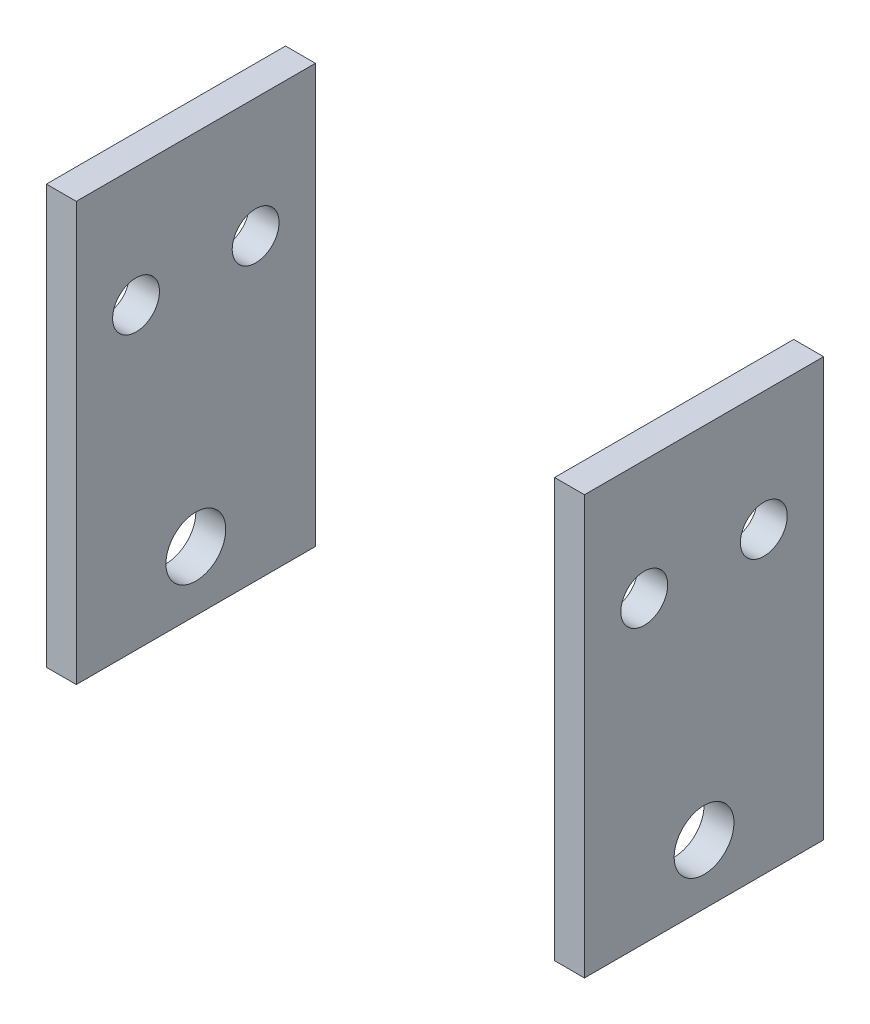
ISO-10303-21;
HEADER;
FILE_DESCRIPTION(('STEP AP214'),'2;1');
FILE_NAME('part.step','',(''),(''),'','','');
FILE_SCHEMA(('AUTOMOTIVE_DESIGN { 1 0 10303 214 1 1 1 1 }'));
ENDSEC;
DATA;
#1=APPLICATION_CONTEXT('core data for automotive mechanical design processes');
#2=APPLICATION_PROTOCOL_DEFINITION('international standard','automotive_design',2000,#1);
#3=PRODUCT_CONTEXT('',#1,'mechanical');
#4=PRODUCT('Part','Part','',(#3));
#5=PRODUCT_RELATED_PRODUCT_CATEGORY('part','',(#4));
#6=PRODUCT_DEFINITION_FORMATION('','',#4);
#7=PRODUCT_DEFINITION_CONTEXT('part definition',#1,'design');
#8=PRODUCT_DEFINITION('design','',#6,#7);
#9=PRODUCT_DEFINITION_SHAPE('','',#8);
#10=(LENGTH_UNIT() NAMED_UNIT(*) SI_UNIT(.MILLI.,.METRE.));
#11=(NAMED_UNIT(*) PLANE_ANGLE_UNIT() SI_UNIT($,.RADIAN.));
#12=(NAMED_UNIT(*) SI_UNIT($,.STERADIAN.) SOLID_ANGLE_UNIT());
#13=UNCERTAINTY_MEASURE_WITH_UNIT(LENGTH_MEASURE(1.E-05),#10,'distance_accuracy_value','');
#14=(GEOMETRIC_REPRESENTATION_CONTEXT(3) GLOBAL_UNCERTAINTY_ASSIGNED_CONTEXT((#13)) GLOBAL_UNIT_ASSIGNED_CONTEXT((#10,
#11,#12)) REPRESENTATION_CONTEXT('',''));
#15=CARTESIAN_POINT('',(0.,0.,0.));
#16=DIRECTION('',(0.,0.,1.));
#17=DIRECTION('',(1.,0.,0.));
#18=AXIS2_PLACEMENT_3D('',#15,#16,#17);
#19=CARTESIAN_POINT('',(15.8750000000003,57.15,25.4));
#20=DIRECTION('',(1.,0.,0.));
#21=DIRECTION('',(0.,1.,0.));
#22=AXIS2_PLACEMENT_3D('',#19,#20,#21);
#23=PLANE('',#22);
#24=CARTESIAN_POINT('',(15.8750000000003,4.36188723061674,12.7));
#25=DIRECTION('',(1.,0.,0.));
#26=DIRECTION('',(0.,1.,0.));
#27=AXIS2_PLACEMENT_3D('',#24,#25,#26);
#28=CIRCLE('',#27,3.175);
#29=CARTESIAN_POINT('',(15.8750000000003,7.53688723061674,12.7));
#30=VERTEX_POINT('',#29);
#31=EDGE_CURVE('E117',#30,#30,#28,.T.);
#32=ORIENTED_EDGE('',*,*,#31,.T.);
#33=EDGE_LOOP('',(#32));
#34=FACE_BOUND('',#33,.T.);
#35=CARTESIAN_POINT('',(15.8750000000003,29.7618872306167,19.05));
#36=DIRECTION('',(1.,0.,0.));
#37=DIRECTION('',(0.,1.,0.));
#38=AXIS2_PLACEMENT_3D('',#35,#36,#37);
#39=CIRCLE('',#38,2.4892);
#40=CARTESIAN_POINT('',(15.8750000000003,32.2510872306167,19.05));
#41=VERTEX_POINT('',#40);
#42=EDGE_CURVE('E151',#41,#41,#39,.T.);
#43=ORIENTED_EDGE('',*,*,#42,.T.);
#44=EDGE_LOOP('',(#43));
#45=FACE_BOUND('',#44,.T.);
#46=CARTESIAN_POINT('',(15.8750000000003,29.7618872306167,6.35));
#47=DIRECTION('',(1.,0.,0.));
#48=DIRECTION('',(0.,1.,0.));
#49=AXIS2_PLACEMENT_3D('',#46,#47,#48);
#50=CIRCLE('',#49,2.4892);
#51=CARTESIAN_POINT('',(15.8750000000003,32.2510872306167,6.35));
#52=VERTEX_POINT('',#51);
#53=EDGE_CURVE('E110',#52,#52,#50,.T.);
#54=ORIENTED_EDGE('',*,*,#53,.T.);
#55=EDGE_LOOP('',(#54));
#56=FACE_BOUND('',#55,.T.);
#57=DIRECTION('',(0.,-1.,0.));
#58=VECTOR('',#57,1.);
#59=CARTESIAN_POINT('',(15.8750000000003,57.15,0.));
#60=LINE('',#59,#58);
#61=CARTESIAN_POINT('',(15.8750000000003,42.4618872306167,0.));
#62=VERTEX_POINT('',#61);
#63=CARTESIAN_POINT('',(15.8750000000003,-1.98811276938327,0.));
#64=VERTEX_POINT('',#63);
#65=EDGE_CURVE('E99',#62,#64,#60,.T.);
#66=ORIENTED_EDGE('',*,*,#65,.T.);
#67=DIRECTION('',(0.,0.,1.));
#68=VECTOR('',#67,1.);
#69=CARTESIAN_POINT('',(15.8750000000003,-1.98811276938326,0.));
#70=LINE('',#69,#68);
#71=CARTESIAN_POINT('',(15.8750000000003,-1.98811276938327,25.4));
#72=VERTEX_POINT('',#71);
#73=EDGE_CURVE('E61',#64,#72,#70,.T.);
#74=ORIENTED_EDGE('',*,*,#73,.T.);
#75=DIRECTION('',(0.,-1.,0.));
#76=VECTOR('',#75,1.);
#77=CARTESIAN_POINT('',(15.8750000000003,57.15,25.4));
#78=LINE('',#77,#76);
#79=CARTESIAN_POINT('',(15.8750000000003,42.4618872306167,25.4));
#80=VERTEX_POINT('',#79);
#81=EDGE_CURVE('E53',#80,#72,#78,.T.);
#82=ORIENTED_EDGE('',*,*,#81,.F.);
#83=DIRECTION('',(0.,0.,-1.));
#84=VECTOR('',#83,1.);
#85=CARTESIAN_POINT('',(15.8750000000003,42.4618872306167,0.));
#86=LINE('',#85,#84);
#87=EDGE_CURVE('E162',#80,#62,#86,.T.);
#88=ORIENTED_EDGE('',*,*,#87,.T.);
#89=EDGE_LOOP('',(#66,#74,#82,#88));
#90=FACE_BOUND('',#89,.T.);
#91=ADVANCED_FACE('F45',(#34,#45,#56,#90),#23,.F.);
#92=CARTESIAN_POINT('',(19.05,57.15,25.4));
#93=DIRECTION('',(-1.,0.,0.));
#94=DIRECTION('',(0.,-1.,0.));
#95=AXIS2_PLACEMENT_3D('',#92,#93,#94);
#96=PLANE('',#95);
#97=CARTESIAN_POINT('',(19.05,4.36188723061674,12.7));
#98=DIRECTION('',(-1.,0.,0.));
#99=DIRECTION('',(0.,-1.,0.));
#100=AXIS2_PLACEMENT_3D('',#97,#98,#99);
#101=CIRCLE('',#100,3.175);
#102=CARTESIAN_POINT('',(19.05,1.18688723061674,12.7));
#103=VERTEX_POINT('',#102);
#104=EDGE_CURVE('E48',#103,#103,#101,.T.);
#105=ORIENTED_EDGE('',*,*,#104,.T.);
#106=EDGE_LOOP('',(#105));
#107=FACE_BOUND('',#106,.T.);
#108=CARTESIAN_POINT('',(19.05,29.7618872306167,19.05));
#109=DIRECTION('',(-1.,0.,0.));
#110=DIRECTION('',(0.,-1.,0.));
#111=AXIS2_PLACEMENT_3D('',#108,#109,#110);
#112=CIRCLE('',#111,2.4892);
#113=CARTESIAN_POINT('',(19.05,27.2726872306167,19.05));
#114=VERTEX_POINT('',#113);
#115=EDGE_CURVE('E116',#114,#114,#112,.T.);
#116=ORIENTED_EDGE('',*,*,#115,.T.);
#117=EDGE_LOOP('',(#116));
#118=FACE_BOUND('',#117,.T.);
#119=CARTESIAN_POINT('',(19.05,29.7618872306167,6.35));
#120=DIRECTION('',(-1.,0.,0.));
#121=DIRECTION('',(0.,-1.,0.));
#122=AXIS2_PLACEMENT_3D('',#119,#120,#121);
#123=CIRCLE('',#122,2.4892);
#124=CARTESIAN_POINT('',(19.05,27.2726872306167,6.35));
#125=VERTEX_POINT('',#124);
#126=EDGE_CURVE('E114',#125,#125,#123,.T.);
#127=ORIENTED_EDGE('',*,*,#126,.T.);
#128=EDGE_LOOP('',(#127));
#129=FACE_BOUND('',#128,.T.);
#130=DIRECTION('',(0.,1.,0.));
#131=VECTOR('',#130,1.);
#132=CARTESIAN_POINT('',(19.05,57.15,25.4));
#133=LINE('',#132,#131);
#134=CARTESIAN_POINT('',(19.05,-1.98811276938326,25.4));
#135=VERTEX_POINT('',#134);
#136=CARTESIAN_POINT('',(19.05,42.4618872306167,25.4));
#137=VERTEX_POINT('',#136);
#138=EDGE_CURVE('E12',#135,#137,#133,.T.);
#139=ORIENTED_EDGE('',*,*,#138,.F.);
#140=DIRECTION('',(0.,0.,-1.));
#141=VECTOR('',#140,1.);
#142=CARTESIAN_POINT('',(19.05,-1.98811276938327,25.4));
#143=LINE('',#142,#141);
#144=CARTESIAN_POINT('',(19.05,-1.98811276938326,0.));
#145=VERTEX_POINT('',#144);
#146=EDGE_CURVE('E88',#135,#145,#143,.T.);
#147=ORIENTED_EDGE('',*,*,#146,.T.);
#148=DIRECTION('',(0.,1.,0.));
#149=VECTOR('',#148,1.);
#150=CARTESIAN_POINT('',(19.05,57.15,0.));
#151=LINE('',#150,#149);
#152=CARTESIAN_POINT('',(19.05,42.4618872306167,0.));
#153=VERTEX_POINT('',#152);
#154=EDGE_CURVE('E105',#145,#153,#151,.T.);
#155=ORIENTED_EDGE('',*,*,#154,.T.);
#156=DIRECTION('',(0.,0.,1.));
#157=VECTOR('',#156,1.);
#158=CARTESIAN_POINT('',(19.05,42.4618872306167,25.4));
#159=LINE('',#158,#157);
#160=EDGE_CURVE('E69',#153,#137,#159,.T.);
#161=ORIENTED_EDGE('',*,*,#160,.T.);
#162=EDGE_LOOP('',(#139,#147,#155,#161));
#163=FACE_BOUND('',#162,.T.);
#164=ADVANCED_FACE('F124',(#107,#118,#129,#163),#96,.F.);
#165=CARTESIAN_POINT('',(0.,0.,25.4));
#166=DIRECTION('',(0.,0.,1.));
#167=DIRECTION('',(1.,0.,0.));
#168=AXIS2_PLACEMENT_3D('',#165,#166,#167);
#169=PLANE('',#168);
#170=DIRECTION('',(1.,0.,0.));
#171=VECTOR('',#170,1.);
#172=CARTESIAN_POINT('',(15.8750000000003,-1.98811276938327,25.4));
#173=LINE('',#172,#171);
#174=EDGE_CURVE('E85',#72,#135,#173,.T.);
#175=ORIENTED_EDGE('',*,*,#174,.T.);
#176=ORIENTED_EDGE('',*,*,#138,.T.);
#177=DIRECTION('',(1.,0.,0.));
#178=VECTOR('',#177,1.);
#179=CARTESIAN_POINT('',(15.8750000000003,42.4618872306167,25.4));
#180=LINE('',#179,#178);
#181=EDGE_CURVE('E104',#80,#137,#180,.T.);
#182=ORIENTED_EDGE('',*,*,#181,.F.);
#183=ORIENTED_EDGE('',*,*,#81,.T.);
#184=EDGE_LOOP('',(#175,#176,#182,#183));
#185=FACE_BOUND('',#184,.T.);
#186=ADVANCED_FACE('F103',(#185),#169,.T.);
#187=CARTESIAN_POINT('',(0.,0.,0.));
#188=DIRECTION('',(0.,0.,1.));
#189=DIRECTION('',(1.,0.,0.));
#190=AXIS2_PLACEMENT_3D('',#187,#188,#189);
#191=PLANE('',#190);
#192=ORIENTED_EDGE('',*,*,#154,.F.);
#193=DIRECTION('',(1.,0.,0.));
#194=VECTOR('',#193,1.);
#195=CARTESIAN_POINT('',(15.8750000000003,-1.98811276938326,0.));
#196=LINE('',#195,#194);
#197=EDGE_CURVE('E92',#64,#145,#196,.T.);
#198=ORIENTED_EDGE('',*,*,#197,.F.);
#199=ORIENTED_EDGE('',*,*,#65,.F.);
#200=DIRECTION('',(1.,0.,0.));
#201=VECTOR('',#200,1.);
#202=CARTESIAN_POINT('',(15.8750000000003,42.4618872306167,0.));
#203=LINE('',#202,#201);
#204=EDGE_CURVE('E100',#62,#153,#203,.T.);
#205=ORIENTED_EDGE('',*,*,#204,.T.);
#206=EDGE_LOOP('',(#192,#198,#199,#205));
#207=FACE_BOUND('',#206,.T.);
#208=ADVANCED_FACE('F166',(#207),#191,.F.);
#209=CARTESIAN_POINT('',(15.8750000000003,29.7618872306167,6.35));
#210=DIRECTION('',(1.,0.,0.));
#211=DIRECTION('',(0.,1.,0.));
#212=AXIS2_PLACEMENT_3D('',#209,#210,#211);
#213=CYLINDRICAL_SURFACE('',#212,2.4892);
#214=ORIENTED_EDGE('',*,*,#53,.F.);
#215=EDGE_LOOP('',(#214));
#216=FACE_BOUND('',#215,.T.);
#217=ORIENTED_EDGE('',*,*,#126,.F.);
#218=EDGE_LOOP('',(#217));
#219=FACE_BOUND('',#218,.T.);
#220=ADVANCED_FACE('F137',(#216,#219),#213,.F.);
#221=CARTESIAN_POINT('',(15.8750000000003,29.7618872306167,19.05));
#222=DIRECTION('',(1.,0.,0.));
#223=DIRECTION('',(0.,1.,0.));
#224=AXIS2_PLACEMENT_3D('',#221,#222,#223);
#225=CYLINDRICAL_SURFACE('',#224,2.4892);
#226=ORIENTED_EDGE('',*,*,#42,.F.);
#227=EDGE_LOOP('',(#226));
#228=FACE_BOUND('',#227,.T.);
#229=ORIENTED_EDGE('',*,*,#115,.F.);
#230=EDGE_LOOP('',(#229));
#231=FACE_BOUND('',#230,.T.);
#232=ADVANCED_FACE('F129',(#228,#231),#225,.F.);
#233=CARTESIAN_POINT('',(15.8750000000003,4.36188723061674,12.7));
#234=DIRECTION('',(1.,0.,0.));
#235=DIRECTION('',(0.,1.,0.));
#236=AXIS2_PLACEMENT_3D('',#233,#234,#235);
#237=CYLINDRICAL_SURFACE('',#236,3.175);
#238=ORIENTED_EDGE('',*,*,#31,.F.);
#239=EDGE_LOOP('',(#238));
#240=FACE_BOUND('',#239,.T.);
#241=ORIENTED_EDGE('',*,*,#104,.F.);
#242=EDGE_LOOP('',(#241));
#243=FACE_BOUND('',#242,.T.);
#244=ADVANCED_FACE('F126',(#240,#243),#237,.F.);
#245=CARTESIAN_POINT('',(15.8750000000003,42.4618872306167,0.));
#246=DIRECTION('',(0.,-1.,0.));
#247=DIRECTION('',(1.,0.,0.));
#248=AXIS2_PLACEMENT_3D('',#245,#246,#247);
#249=PLANE('',#248);
#250=ORIENTED_EDGE('',*,*,#204,.F.);
#251=ORIENTED_EDGE('',*,*,#87,.F.);
#252=ORIENTED_EDGE('',*,*,#181,.T.);
#253=ORIENTED_EDGE('',*,*,#160,.F.);
#254=EDGE_LOOP('',(#250,#251,#252,#253));
#255=FACE_BOUND('',#254,.T.);
#256=ADVANCED_FACE('F128',(#255),#249,.F.);
#257=CARTESIAN_POINT('',(15.8750000000003,-1.98811276938326,0.));
#258=DIRECTION('',(0.,1.,0.));
#259=DIRECTION('',(-1.,0.,0.));
#260=AXIS2_PLACEMENT_3D('',#257,#258,#259);
#261=PLANE('',#260);
#262=ORIENTED_EDGE('',*,*,#174,.F.);
#263=ORIENTED_EDGE('',*,*,#73,.F.);
#264=ORIENTED_EDGE('',*,*,#197,.T.);
#265=ORIENTED_EDGE('',*,*,#146,.F.);
#266=EDGE_LOOP('',(#262,#263,#264,#265));
#267=FACE_BOUND('',#266,.T.);
#268=ADVANCED_FACE('F86',(#267),#261,.F.);
#269=CLOSED_SHELL('',(#91,#164,#186,#208,#220,#232,#244,#256,#268));
#270=MANIFOLD_SOLID_BREP('B2',#269);
#271=CARTESIAN_POINT('',(69.85,57.15,25.4));
#272=DIRECTION('',(1.,0.,0.));
#273=DIRECTION('',(0.,1.,0.));
#274=AXIS2_PLACEMENT_3D('',#271,#272,#273);
#275=PLANE('',#274);
#276=CARTESIAN_POINT('',(69.85,4.36188723061675,12.7));
#277=DIRECTION('',(1.,0.,0.));
#278=DIRECTION('',(0.,1.,0.));
#279=AXIS2_PLACEMENT_3D('',#276,#277,#278);
#280=CIRCLE('',#279,3.175);
#281=CARTESIAN_POINT('',(69.85,7.53688723061675,12.7));
#282=VERTEX_POINT('',#281);
#283=EDGE_CURVE('E292',#282,#282,#280,.T.);
#284=ORIENTED_EDGE('',*,*,#283,.T.);
#285=EDGE_LOOP('',(#284));
#286=FACE_BOUND('',#285,.T.);
#287=CARTESIAN_POINT('',(69.85,29.7618872306168,19.05));
#288=DIRECTION('',(1.,0.,0.));
#289=DIRECTION('',(0.,1.,0.));
#290=AXIS2_PLACEMENT_3D('',#287,#288,#289);
#291=CIRCLE('',#290,2.4892);
#292=CARTESIAN_POINT('',(69.85,32.2510872306167,19.05));
#293=VERTEX_POINT('',#292);
#294=EDGE_CURVE('E300',#293,#293,#291,.T.);
#295=ORIENTED_EDGE('',*,*,#294,.T.);
#296=EDGE_LOOP('',(#295));
#297=FACE_BOUND('',#296,.T.);
#298=CARTESIAN_POINT('',(69.85,29.7618872306168,6.35));
#299=DIRECTION('',(1.,0.,0.));
#300=DIRECTION('',(0.,1.,0.));
#301=AXIS2_PLACEMENT_3D('',#298,#299,#300);
#302=CIRCLE('',#301,2.4892);
#303=CARTESIAN_POINT('',(69.85,32.2510872306168,6.35));
#304=VERTEX_POINT('',#303);
#305=EDGE_CURVE('E303',#304,#304,#302,.T.);
#306=ORIENTED_EDGE('',*,*,#305,.T.);
#307=EDGE_LOOP('',(#306));
#308=FACE_BOUND('',#307,.T.);
#309=DIRECTION('',(0.,-1.,0.));
#310=VECTOR('',#309,1.);
#311=CARTESIAN_POINT('',(69.85,57.15,0.));
#312=LINE('',#311,#310);
#313=CARTESIAN_POINT('',(69.85,42.4618872306168,0.));
#314=VERTEX_POINT('',#313);
#315=CARTESIAN_POINT('',(69.85,-1.98811276938324,0.));
#316=VERTEX_POINT('',#315);
#317=EDGE_CURVE('E288',#314,#316,#312,.T.);
#318=ORIENTED_EDGE('',*,*,#317,.T.);
#319=DIRECTION('',(0.,0.,1.));
#320=VECTOR('',#319,1.);
#321=CARTESIAN_POINT('',(69.85,-1.98811276938325,25.4));
#322=LINE('',#321,#320);
#323=CARTESIAN_POINT('',(69.85,-1.98811276938324,25.4));
#324=VERTEX_POINT('',#323);
#325=EDGE_CURVE('E254',#316,#324,#322,.T.);
#326=ORIENTED_EDGE('',*,*,#325,.T.);
#327=DIRECTION('',(0.,-1.,0.));
#328=VECTOR('',#327,1.);
#329=CARTESIAN_POINT('',(69.85,57.15,25.4));
#330=LINE('',#329,#328);
#331=CARTESIAN_POINT('',(69.85,42.4618872306168,25.4));
#332=VERTEX_POINT('',#331);
#333=EDGE_CURVE('E287',#332,#324,#330,.T.);
#334=ORIENTED_EDGE('',*,*,#333,.F.);
#335=DIRECTION('',(0.,0.,-1.));
#336=VECTOR('',#335,1.);
#337=CARTESIAN_POINT('',(69.85,42.4618872306168,25.4));
#338=LINE('',#337,#336);
#339=EDGE_CURVE('E316',#332,#314,#338,.T.);
#340=ORIENTED_EDGE('',*,*,#339,.T.);
#341=EDGE_LOOP('',(#318,#326,#334,#340));
#342=FACE_BOUND('',#341,.T.);
#343=ADVANCED_FACE('F232',(#286,#297,#308,#342),#275,.F.);
#344=CARTESIAN_POINT('',(73.0249999999997,57.15,25.4));
#345=DIRECTION('',(-1.,0.,0.));
#346=DIRECTION('',(0.,-1.,0.));
#347=AXIS2_PLACEMENT_3D('',#344,#345,#346);
#348=PLANE('',#347);
#349=CARTESIAN_POINT('',(73.0249999999997,4.36188723061675,12.7));
#350=DIRECTION('',(1.,0.,0.));
#351=DIRECTION('',(0.,1.,0.));
#352=AXIS2_PLACEMENT_3D('',#349,#350,#351);
#353=CIRCLE('',#352,3.175);
#354=CARTESIAN_POINT('',(73.0249999999997,7.53688723061675,12.7));
#355=VERTEX_POINT('',#354);
#356=EDGE_CURVE('E306',#355,#355,#353,.T.);
#357=ORIENTED_EDGE('',*,*,#356,.F.);
#358=EDGE_LOOP('',(#357));
#359=FACE_BOUND('',#358,.T.);
#360=CARTESIAN_POINT('',(73.0249999999997,29.7618872306168,19.05));
#361=DIRECTION('',(1.,0.,0.));
#362=DIRECTION('',(0.,1.,0.));
#363=AXIS2_PLACEMENT_3D('',#360,#361,#362);
#364=CIRCLE('',#363,2.4892);
#365=CARTESIAN_POINT('',(73.0249999999997,32.2510872306167,19.05));
#366=VERTEX_POINT('',#365);
#367=EDGE_CURVE('E310',#366,#366,#364,.T.);
#368=ORIENTED_EDGE('',*,*,#367,.F.);
#369=EDGE_LOOP('',(#368));
#370=FACE_BOUND('',#369,.T.);
#371=CARTESIAN_POINT('',(73.0249999999997,29.7618872306168,6.35));
#372=DIRECTION('',(1.,0.,0.));
#373=DIRECTION('',(0.,1.,0.));
#374=AXIS2_PLACEMENT_3D('',#371,#372,#373);
#375=CIRCLE('',#374,2.4892);
#376=CARTESIAN_POINT('',(73.0249999999997,32.2510872306168,6.35));
#377=VERTEX_POINT('',#376);
#378=EDGE_CURVE('E307',#377,#377,#375,.T.);
#379=ORIENTED_EDGE('',*,*,#378,.F.);
#380=EDGE_LOOP('',(#379));
#381=FACE_BOUND('',#380,.T.);
#382=DIRECTION('',(0.,1.,0.));
#383=VECTOR('',#382,1.);
#384=CARTESIAN_POINT('',(73.0249999999997,57.15,25.4));
#385=LINE('',#384,#383);
#386=CARTESIAN_POINT('',(73.0249999999997,-1.98811276938324,25.4));
#387=VERTEX_POINT('',#386);
#388=CARTESIAN_POINT('',(73.0249999999997,42.4618872306168,25.4));
#389=VERTEX_POINT('',#388);
#390=EDGE_CURVE('E282',#387,#389,#385,.T.);
#391=ORIENTED_EDGE('',*,*,#390,.F.);
#392=DIRECTION('',(0.,0.,1.));
#393=VECTOR('',#392,1.);
#394=CARTESIAN_POINT('',(73.0249999999997,-1.98811276938324,0.));
#395=LINE('',#394,#393);
#396=CARTESIAN_POINT('',(73.0249999999997,-1.98811276938324,0.));
#397=VERTEX_POINT('',#396);
#398=EDGE_CURVE('E270',#397,#387,#395,.T.);
#399=ORIENTED_EDGE('',*,*,#398,.F.);
#400=DIRECTION('',(0.,1.,0.));
#401=VECTOR('',#400,1.);
#402=CARTESIAN_POINT('',(73.0249999999997,57.15,0.));
#403=LINE('',#402,#401);
#404=CARTESIAN_POINT('',(73.0249999999997,42.4618872306168,0.));
#405=VERTEX_POINT('',#404);
#406=EDGE_CURVE('E280',#397,#405,#403,.T.);
#407=ORIENTED_EDGE('',*,*,#406,.T.);
#408=DIRECTION('',(0.,0.,-1.));
#409=VECTOR('',#408,1.);
#410=CARTESIAN_POINT('',(73.0249999999997,42.4618872306168,0.));
#411=LINE('',#410,#409);
#412=EDGE_CURVE('E246',#389,#405,#411,.T.);
#413=ORIENTED_EDGE('',*,*,#412,.F.);
#414=EDGE_LOOP('',(#391,#399,#407,#413));
#415=FACE_BOUND('',#414,.T.);
#416=ADVANCED_FACE('F279',(#359,#370,#381,#415),#348,.F.);
#417=CARTESIAN_POINT('',(0.,0.,25.4));
#418=DIRECTION('',(0.,0.,1.));
#419=DIRECTION('',(1.,0.,0.));
#420=AXIS2_PLACEMENT_3D('',#417,#418,#419);
#421=PLANE('',#420);
#422=DIRECTION('',(1.,0.,0.));
#423=VECTOR('',#422,1.);
#424=CARTESIAN_POINT('',(15.8750000000003,-1.98811276938327,25.4));
#425=LINE('',#424,#423);
#426=EDGE_CURVE('E283',#324,#387,#425,.T.);
#427=ORIENTED_EDGE('',*,*,#426,.T.);
#428=ORIENTED_EDGE('',*,*,#390,.T.);
#429=DIRECTION('',(1.,0.,0.));
#430=VECTOR('',#429,1.);
#431=CARTESIAN_POINT('',(15.8750000000003,42.4618872306167,25.4));
#432=LINE('',#431,#430);
#433=EDGE_CURVE('E284',#332,#389,#432,.T.);
#434=ORIENTED_EDGE('',*,*,#433,.F.);
#435=ORIENTED_EDGE('',*,*,#333,.T.);
#436=EDGE_LOOP('',(#427,#428,#434,#435));
#437=FACE_BOUND('',#436,.T.);
#438=ADVANCED_FACE('F321',(#437),#421,.T.);
#439=CARTESIAN_POINT('',(0.,0.,0.));
#440=DIRECTION('',(0.,0.,1.));
#441=DIRECTION('',(1.,0.,0.));
#442=AXIS2_PLACEMENT_3D('',#439,#440,#441);
#443=PLANE('',#442);
#444=ORIENTED_EDGE('',*,*,#406,.F.);
#445=DIRECTION('',(-1.,0.,0.));
#446=VECTOR('',#445,1.);
#447=CARTESIAN_POINT('',(0.,-1.98811276938327,0.));
#448=LINE('',#447,#446);
#449=EDGE_CURVE('E43',#397,#316,#448,.T.);
#450=ORIENTED_EDGE('',*,*,#449,.T.);
#451=ORIENTED_EDGE('',*,*,#317,.F.);
#452=DIRECTION('',(1.,0.,0.));
#453=VECTOR('',#452,1.);
#454=CARTESIAN_POINT('',(0.,42.4618872306167,0.));
#455=LINE('',#454,#453);
#456=EDGE_CURVE('E239',#314,#405,#455,.T.);
#457=ORIENTED_EDGE('',*,*,#456,.T.);
#458=EDGE_LOOP('',(#444,#450,#451,#457));
#459=FACE_BOUND('',#458,.T.);
#460=ADVANCED_FACE('F286',(#459),#443,.F.);
#461=CARTESIAN_POINT('',(15.8750000000003,29.7618872306167,6.35));
#462=DIRECTION('',(1.,0.,0.));
#463=DIRECTION('',(0.,1.,0.));
#464=AXIS2_PLACEMENT_3D('',#461,#462,#463);
#465=CYLINDRICAL_SURFACE('',#464,2.4892);
#466=ORIENTED_EDGE('',*,*,#378,.T.);
#467=EDGE_LOOP('',(#466));
#468=FACE_BOUND('',#467,.T.);
#469=ORIENTED_EDGE('',*,*,#305,.F.);
#470=EDGE_LOOP('',(#469));
#471=FACE_BOUND('',#470,.T.);
#472=ADVANCED_FACE('F348',(#468,#471),#465,.F.);
#473=CARTESIAN_POINT('',(15.8750000000003,29.7618872306167,19.05));
#474=DIRECTION('',(1.,0.,0.));
#475=DIRECTION('',(0.,1.,0.));
#476=AXIS2_PLACEMENT_3D('',#473,#474,#475);
#477=CYLINDRICAL_SURFACE('',#476,2.4892);
#478=ORIENTED_EDGE('',*,*,#367,.T.);
#479=EDGE_LOOP('',(#478));
#480=FACE_BOUND('',#479,.T.);
#481=ORIENTED_EDGE('',*,*,#294,.F.);
#482=EDGE_LOOP('',(#481));
#483=FACE_BOUND('',#482,.T.);
#484=ADVANCED_FACE('F333',(#480,#483),#477,.F.);
#485=CARTESIAN_POINT('',(15.8750000000003,4.36188723061674,12.7));
#486=DIRECTION('',(1.,0.,0.));
#487=DIRECTION('',(0.,1.,0.));
#488=AXIS2_PLACEMENT_3D('',#485,#486,#487);
#489=CYLINDRICAL_SURFACE('',#488,3.175);
#490=ORIENTED_EDGE('',*,*,#356,.T.);
#491=EDGE_LOOP('',(#490));
#492=FACE_BOUND('',#491,.T.);
#493=ORIENTED_EDGE('',*,*,#283,.F.);
#494=EDGE_LOOP('',(#493));
#495=FACE_BOUND('',#494,.T.);
#496=ADVANCED_FACE('F326',(#492,#495),#489,.F.);
#497=CARTESIAN_POINT('',(15.8750000000003,42.4618872306167,0.));
#498=DIRECTION('',(0.,-1.,0.));
#499=DIRECTION('',(1.,0.,0.));
#500=AXIS2_PLACEMENT_3D('',#497,#498,#499);
#501=PLANE('',#500);
#502=ORIENTED_EDGE('',*,*,#433,.T.);
#503=ORIENTED_EDGE('',*,*,#412,.T.);
#504=ORIENTED_EDGE('',*,*,#456,.F.);
#505=ORIENTED_EDGE('',*,*,#339,.F.);
#506=EDGE_LOOP('',(#502,#503,#504,#505));
#507=FACE_BOUND('',#506,.T.);
#508=ADVANCED_FACE('F324',(#507),#501,.F.);
#509=CARTESIAN_POINT('',(15.8750000000003,-1.98811276938326,0.));
#510=DIRECTION('',(0.,1.,0.));
#511=DIRECTION('',(-1.,0.,0.));
#512=AXIS2_PLACEMENT_3D('',#509,#510,#511);
#513=PLANE('',#512);
#514=ORIENTED_EDGE('',*,*,#449,.F.);
#515=ORIENTED_EDGE('',*,*,#398,.T.);
#516=ORIENTED_EDGE('',*,*,#426,.F.);
#517=ORIENTED_EDGE('',*,*,#325,.F.);
#518=EDGE_LOOP('',(#514,#515,#516,#517));
#519=FACE_BOUND('',#518,.T.);
#520=ADVANCED_FACE('F269',(#519),#513,.F.);
#521=CLOSED_SHELL('',(#343,#416,#438,#460,#472,#484,#496,#508,#520));
#522=MANIFOLD_SOLID_BREP('B6',#521);
#523=ADVANCED_BREP_SHAPE_REPRESENTATION('',(#18,#270,#522),#14);
#524=SHAPE_DEFINITION_REPRESENTATION(#9,#523);
ENDSEC;
END-ISO-10303-21;
